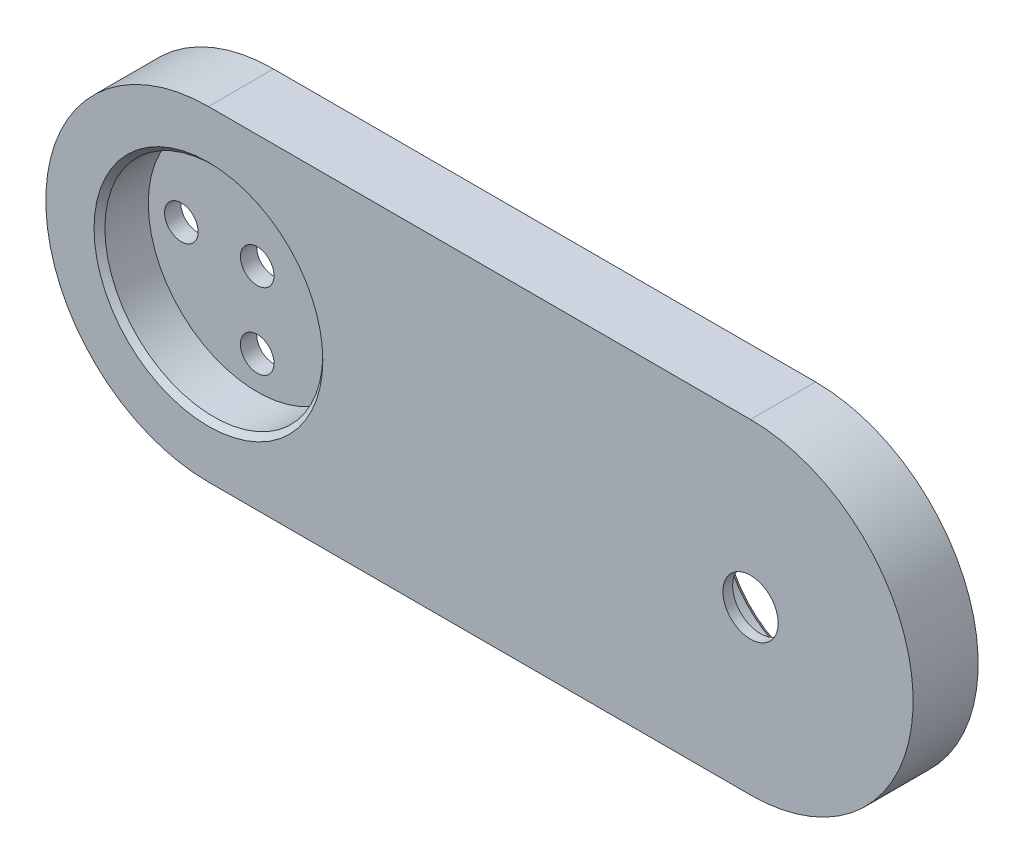
ISO-10303-21;
HEADER;
FILE_DESCRIPTION(('STEP AP214'),'2;1');
FILE_NAME('part.step','',(''),(''),'','','');
FILE_SCHEMA(('AUTOMOTIVE_DESIGN { 1 0 10303 214 1 1 1 1 }'));
ENDSEC;
DATA;
#1=APPLICATION_CONTEXT('core data for automotive mechanical design processes');
#2=APPLICATION_PROTOCOL_DEFINITION('international standard','automotive_design',2000,#1);
#3=PRODUCT_CONTEXT('',#1,'mechanical');
#4=PRODUCT('Part','Part','',(#3));
#5=PRODUCT_RELATED_PRODUCT_CATEGORY('part','',(#4));
#6=PRODUCT_DEFINITION_FORMATION('','',#4);
#7=PRODUCT_DEFINITION_CONTEXT('part definition',#1,'design');
#8=PRODUCT_DEFINITION('design','',#6,#7);
#9=PRODUCT_DEFINITION_SHAPE('','',#8);
#10=(LENGTH_UNIT() NAMED_UNIT(*) SI_UNIT(.MILLI.,.METRE.));
#11=(NAMED_UNIT(*) PLANE_ANGLE_UNIT() SI_UNIT($,.RADIAN.));
#12=(NAMED_UNIT(*) SI_UNIT($,.STERADIAN.) SOLID_ANGLE_UNIT());
#13=UNCERTAINTY_MEASURE_WITH_UNIT(LENGTH_MEASURE(1.E-05),#10,'distance_accuracy_value','');
#14=(GEOMETRIC_REPRESENTATION_CONTEXT(3) GLOBAL_UNCERTAINTY_ASSIGNED_CONTEXT((#13)) GLOBAL_UNIT_ASSIGNED_CONTEXT((#10,
#11,#12)) REPRESENTATION_CONTEXT('',''));
#15=CARTESIAN_POINT('',(0.,0.,0.));
#16=DIRECTION('',(0.,0.,1.));
#17=DIRECTION('',(1.,0.,0.));
#18=AXIS2_PLACEMENT_3D('',#15,#16,#17);
#19=CARTESIAN_POINT('',(-25.,0.,6.));
#20=DIRECTION('',(0.,0.,-1.));
#21=DIRECTION('',(-1.,0.,0.));
#22=AXIS2_PLACEMENT_3D('',#19,#20,#21);
#23=CYLINDRICAL_SURFACE('',#22,15.);
#24=CARTESIAN_POINT('',(-25.,0.,0.));
#25=DIRECTION('',(0.,0.,1.));
#26=DIRECTION('',(-1.,0.,0.));
#27=AXIS2_PLACEMENT_3D('',#24,#25,#26);
#28=CIRCLE('',#27,15.);
#29=CARTESIAN_POINT('',(-25.,15.,0.));
#30=VERTEX_POINT('',#29);
#31=CARTESIAN_POINT('',(-25.,-15.,0.));
#32=VERTEX_POINT('',#31);
#33=EDGE_CURVE('E120',#30,#32,#28,.T.);
#34=ORIENTED_EDGE('',*,*,#33,.T.);
#35=DIRECTION('',(0.,0.,-1.));
#36=VECTOR('',#35,1.);
#37=CARTESIAN_POINT('',(-25.,-15.,6.));
#38=LINE('',#37,#36);
#39=CARTESIAN_POINT('',(-25.,-15.,6.));
#40=VERTEX_POINT('',#39);
#41=EDGE_CURVE('E109',#40,#32,#38,.T.);
#42=ORIENTED_EDGE('',*,*,#41,.F.);
#43=CARTESIAN_POINT('',(-25.,0.,6.));
#44=DIRECTION('',(0.,0.,1.));
#45=DIRECTION('',(-1.,0.,0.));
#46=AXIS2_PLACEMENT_3D('',#43,#44,#45);
#47=CIRCLE('',#46,15.);
#48=CARTESIAN_POINT('',(-25.,15.,6.));
#49=VERTEX_POINT('',#48);
#50=EDGE_CURVE('E101',#49,#40,#47,.T.);
#51=ORIENTED_EDGE('',*,*,#50,.F.);
#52=DIRECTION('',(0.,0.,-1.));
#53=VECTOR('',#52,1.);
#54=CARTESIAN_POINT('',(-25.,15.,6.));
#55=LINE('',#54,#53);
#56=EDGE_CURVE('E116',#49,#30,#55,.T.);
#57=ORIENTED_EDGE('',*,*,#56,.T.);
#58=EDGE_LOOP('',(#34,#42,#51,#57));
#59=FACE_BOUND('',#58,.T.);
#60=ADVANCED_FACE('F46',(#59),#23,.T.);
#61=CARTESIAN_POINT('',(25.,-15.,6.));
#62=DIRECTION('',(0.,1.,0.));
#63=DIRECTION('',(0.,0.,1.));
#64=AXIS2_PLACEMENT_3D('',#61,#62,#63);
#65=PLANE('',#64);
#66=DIRECTION('',(1.,0.,0.));
#67=VECTOR('',#66,1.);
#68=CARTESIAN_POINT('',(25.,-15.,0.));
#69=LINE('',#68,#67);
#70=CARTESIAN_POINT('',(25.,-15.,0.));
#71=VERTEX_POINT('',#70);
#72=EDGE_CURVE('E107',#32,#71,#69,.T.);
#73=ORIENTED_EDGE('',*,*,#72,.T.);
#74=DIRECTION('',(0.,0.,-1.));
#75=VECTOR('',#74,1.);
#76=CARTESIAN_POINT('',(25.,-15.,6.));
#77=LINE('',#76,#75);
#78=CARTESIAN_POINT('',(25.,-15.,6.));
#79=VERTEX_POINT('',#78);
#80=EDGE_CURVE('E105',#79,#71,#77,.T.);
#81=ORIENTED_EDGE('',*,*,#80,.F.);
#82=DIRECTION('',(1.,0.,0.));
#83=VECTOR('',#82,1.);
#84=CARTESIAN_POINT('',(25.,-15.,6.));
#85=LINE('',#84,#83);
#86=EDGE_CURVE('E96',#40,#79,#85,.T.);
#87=ORIENTED_EDGE('',*,*,#86,.F.);
#88=ORIENTED_EDGE('',*,*,#41,.T.);
#89=EDGE_LOOP('',(#73,#81,#87,#88));
#90=FACE_BOUND('',#89,.T.);
#91=ADVANCED_FACE('F106',(#90),#65,.F.);
#92=CARTESIAN_POINT('',(25.,0.,6.));
#93=DIRECTION('',(0.,0.,-1.));
#94=DIRECTION('',(-1.,0.,0.));
#95=AXIS2_PLACEMENT_3D('',#92,#93,#94);
#96=CYLINDRICAL_SURFACE('',#95,15.);
#97=CARTESIAN_POINT('',(25.,0.,0.));
#98=DIRECTION('',(0.,0.,1.));
#99=DIRECTION('',(-1.,0.,0.));
#100=AXIS2_PLACEMENT_3D('',#97,#98,#99);
#101=CIRCLE('',#100,15.);
#102=CARTESIAN_POINT('',(25.,15.,0.));
#103=VERTEX_POINT('',#102);
#104=EDGE_CURVE('E82',#71,#103,#101,.T.);
#105=ORIENTED_EDGE('',*,*,#104,.T.);
#106=DIRECTION('',(0.,0.,-1.));
#107=VECTOR('',#106,1.);
#108=CARTESIAN_POINT('',(25.,15.,6.));
#109=LINE('',#108,#107);
#110=CARTESIAN_POINT('',(25.,15.,6.));
#111=VERTEX_POINT('',#110);
#112=EDGE_CURVE('E110',#111,#103,#109,.T.);
#113=ORIENTED_EDGE('',*,*,#112,.F.);
#114=CARTESIAN_POINT('',(25.,0.,6.));
#115=DIRECTION('',(0.,0.,1.));
#116=DIRECTION('',(-1.,0.,0.));
#117=AXIS2_PLACEMENT_3D('',#114,#115,#116);
#118=CIRCLE('',#117,15.);
#119=EDGE_CURVE('E99',#79,#111,#118,.T.);
#120=ORIENTED_EDGE('',*,*,#119,.F.);
#121=ORIENTED_EDGE('',*,*,#80,.T.);
#122=EDGE_LOOP('',(#105,#113,#120,#121));
#123=FACE_BOUND('',#122,.T.);
#124=ADVANCED_FACE('F112',(#123),#96,.T.);
#125=CARTESIAN_POINT('',(-25.,15.,6.));
#126=DIRECTION('',(0.,-1.,0.));
#127=DIRECTION('',(0.,0.,-1.));
#128=AXIS2_PLACEMENT_3D('',#125,#126,#127);
#129=PLANE('',#128);
#130=DIRECTION('',(-1.,0.,0.));
#131=VECTOR('',#130,1.);
#132=CARTESIAN_POINT('',(-25.,15.,0.));
#133=LINE('',#132,#131);
#134=EDGE_CURVE('E88',#103,#30,#133,.T.);
#135=ORIENTED_EDGE('',*,*,#134,.T.);
#136=ORIENTED_EDGE('',*,*,#56,.F.);
#137=DIRECTION('',(-1.,0.,0.));
#138=VECTOR('',#137,1.);
#139=CARTESIAN_POINT('',(-25.,15.,6.));
#140=LINE('',#139,#138);
#141=EDGE_CURVE('E65',#111,#49,#140,.T.);
#142=ORIENTED_EDGE('',*,*,#141,.F.);
#143=ORIENTED_EDGE('',*,*,#112,.T.);
#144=EDGE_LOOP('',(#135,#136,#142,#143));
#145=FACE_BOUND('',#144,.T.);
#146=ADVANCED_FACE('F175',(#145),#129,.F.);
#147=CARTESIAN_POINT('',(-25.,0.,6.));
#148=DIRECTION('',(0.,0.,-1.));
#149=DIRECTION('',(-1.,0.,0.));
#150=AXIS2_PLACEMENT_3D('',#147,#148,#149);
#151=PLANE('',#150);
#152=CARTESIAN_POINT('',(-25.,0.,6.));
#153=DIRECTION('',(0.,0.,-1.));
#154=DIRECTION('',(-1.,0.,0.));
#155=AXIS2_PLACEMENT_3D('',#152,#153,#154);
#156=CIRCLE('',#155,10.55);
#157=CARTESIAN_POINT('',(-35.55,0.,6.));
#158=VERTEX_POINT('',#157);
#159=EDGE_CURVE('E11',#158,#158,#156,.T.);
#160=ORIENTED_EDGE('',*,*,#159,.T.);
#161=EDGE_LOOP('',(#160));
#162=FACE_BOUND('',#161,.T.);
#163=CARTESIAN_POINT('',(25.,0.,6.));
#164=DIRECTION('',(0.,0.,-1.));
#165=DIRECTION('',(-1.,0.,0.));
#166=AXIS2_PLACEMENT_3D('',#163,#164,#165);
#167=CIRCLE('',#166,2.55);
#168=CARTESIAN_POINT('',(22.45,0.,6.));
#169=VERTEX_POINT('',#168);
#170=EDGE_CURVE('E269',#169,#169,#167,.T.);
#171=ORIENTED_EDGE('',*,*,#170,.T.);
#172=EDGE_LOOP('',(#171));
#173=FACE_BOUND('',#172,.T.);
#174=ORIENTED_EDGE('',*,*,#50,.T.);
#175=ORIENTED_EDGE('',*,*,#86,.T.);
#176=ORIENTED_EDGE('',*,*,#119,.T.);
#177=ORIENTED_EDGE('',*,*,#141,.T.);
#178=EDGE_LOOP('',(#174,#175,#176,#177));
#179=FACE_BOUND('',#178,.T.);
#180=ADVANCED_FACE('F97',(#162,#173,#179),#151,.F.);
#181=CARTESIAN_POINT('',(-25.,0.,0.));
#182=DIRECTION('',(0.,0.,-1.));
#183=DIRECTION('',(-1.,0.,0.));
#184=AXIS2_PLACEMENT_3D('',#181,#182,#183);
#185=PLANE('',#184);
#186=CARTESIAN_POINT('',(25.,0.,0.));
#187=DIRECTION('',(0.,0.,-1.));
#188=DIRECTION('',(-1.,0.,0.));
#189=AXIS2_PLACEMENT_3D('',#186,#187,#188);
#190=CIRCLE('',#189,8.47500000000002);
#191=CARTESIAN_POINT('',(16.525,0.,0.));
#192=VERTEX_POINT('',#191);
#193=EDGE_CURVE('E141',#192,#192,#190,.F.);
#194=ORIENTED_EDGE('',*,*,#193,.T.);
#195=EDGE_LOOP('',(#194));
#196=FACE_BOUND('',#195,.T.);
#197=CARTESIAN_POINT('',(-18.,0.,0.));
#198=DIRECTION('',(0.,0.,1.));
#199=DIRECTION('',(1.,0.,0.));
#200=AXIS2_PLACEMENT_3D('',#197,#198,#199);
#201=CIRCLE('',#200,1.55);
#202=CARTESIAN_POINT('',(-16.45,0.,0.));
#203=VERTEX_POINT('',#202);
#204=EDGE_CURVE('E254',#203,#203,#201,.T.);
#205=ORIENTED_EDGE('',*,*,#204,.T.);
#206=EDGE_LOOP('',(#205));
#207=FACE_BOUND('',#206,.T.);
#208=CARTESIAN_POINT('',(-32.,0.,0.));
#209=DIRECTION('',(0.,0.,1.));
#210=DIRECTION('',(1.,0.,0.));
#211=AXIS2_PLACEMENT_3D('',#208,#209,#210);
#212=CIRCLE('',#211,1.55);
#213=CARTESIAN_POINT('',(-30.45,0.,0.));
#214=VERTEX_POINT('',#213);
#215=EDGE_CURVE('E232',#214,#214,#212,.T.);
#216=ORIENTED_EDGE('',*,*,#215,.T.);
#217=EDGE_LOOP('',(#216));
#218=FACE_BOUND('',#217,.T.);
#219=CARTESIAN_POINT('',(-25.,7.,0.));
#220=DIRECTION('',(0.,0.,1.));
#221=DIRECTION('',(1.,0.,0.));
#222=AXIS2_PLACEMENT_3D('',#219,#220,#221);
#223=CIRCLE('',#222,1.55);
#224=CARTESIAN_POINT('',(-23.45,7.,0.));
#225=VERTEX_POINT('',#224);
#226=EDGE_CURVE('E226',#225,#225,#223,.T.);
#227=ORIENTED_EDGE('',*,*,#226,.T.);
#228=EDGE_LOOP('',(#227));
#229=FACE_BOUND('',#228,.T.);
#230=CARTESIAN_POINT('',(-25.,-7.,0.));
#231=DIRECTION('',(0.,0.,1.));
#232=DIRECTION('',(1.,0.,0.));
#233=AXIS2_PLACEMENT_3D('',#230,#231,#232);
#234=CIRCLE('',#233,1.55);
#235=CARTESIAN_POINT('',(-23.45,-7.,0.));
#236=VERTEX_POINT('',#235);
#237=EDGE_CURVE('E245',#236,#236,#234,.T.);
#238=ORIENTED_EDGE('',*,*,#237,.T.);
#239=EDGE_LOOP('',(#238));
#240=FACE_BOUND('',#239,.T.);
#241=CARTESIAN_POINT('',(-25.,0.,0.));
#242=DIRECTION('',(0.,0.,1.));
#243=DIRECTION('',(1.,0.,0.));
#244=AXIS2_PLACEMENT_3D('',#241,#242,#243);
#245=CIRCLE('',#244,1.55);
#246=CARTESIAN_POINT('',(-23.45,0.,0.));
#247=VERTEX_POINT('',#246);
#248=EDGE_CURVE('E261',#247,#247,#245,.T.);
#249=ORIENTED_EDGE('',*,*,#248,.T.);
#250=EDGE_LOOP('',(#249));
#251=FACE_BOUND('',#250,.T.);
#252=ORIENTED_EDGE('',*,*,#33,.F.);
#253=ORIENTED_EDGE('',*,*,#134,.F.);
#254=ORIENTED_EDGE('',*,*,#104,.F.);
#255=ORIENTED_EDGE('',*,*,#72,.F.);
#256=EDGE_LOOP('',(#252,#253,#254,#255));
#257=FACE_BOUND('',#256,.T.);
#258=ADVANCED_FACE('F178',(#196,#207,#218,#229,#240,#251,#257),#185,.T.);
#259=CARTESIAN_POINT('',(-25.,0.,1.5));
#260=DIRECTION('',(0.,0.,1.));
#261=DIRECTION('',(1.,0.,0.));
#262=AXIS2_PLACEMENT_3D('',#259,#260,#261);
#263=CYLINDRICAL_SURFACE('',#262,10.05);
#264=CARTESIAN_POINT('',(-25.,0.,5.49999999999999));
#265=DIRECTION('',(0.,0.,-1.));
#266=DIRECTION('',(-1.,0.,0.));
#267=AXIS2_PLACEMENT_3D('',#264,#265,#266);
#268=CIRCLE('',#267,10.05);
#269=CARTESIAN_POINT('',(-35.05,0.,5.49999999999999));
#270=VERTEX_POINT('',#269);
#271=EDGE_CURVE('E57',#270,#270,#268,.F.);
#272=ORIENTED_EDGE('',*,*,#271,.T.);
#273=EDGE_LOOP('',(#272));
#274=FACE_BOUND('',#273,.T.);
#275=CARTESIAN_POINT('',(-25.,0.,1.5));
#276=DIRECTION('',(0.,0.,1.));
#277=DIRECTION('',(1.,0.,0.));
#278=AXIS2_PLACEMENT_3D('',#275,#276,#277);
#279=CIRCLE('',#278,10.05);
#280=CARTESIAN_POINT('',(-14.95,0.,1.5));
#281=VERTEX_POINT('',#280);
#282=EDGE_CURVE('E124',#281,#281,#279,.T.);
#283=ORIENTED_EDGE('',*,*,#282,.F.);
#284=EDGE_LOOP('',(#283));
#285=FACE_BOUND('',#284,.T.);
#286=ADVANCED_FACE('F148',(#274,#285),#263,.F.);
#287=CARTESIAN_POINT('',(-25.,0.,1.5));
#288=DIRECTION('',(0.,0.,1.));
#289=DIRECTION('',(1.,0.,0.));
#290=AXIS2_PLACEMENT_3D('',#287,#288,#289);
#291=PLANE('',#290);
#292=CARTESIAN_POINT('',(-25.,0.,1.5));
#293=DIRECTION('',(0.,0.,1.));
#294=DIRECTION('',(1.,0.,0.));
#295=AXIS2_PLACEMENT_3D('',#292,#293,#294);
#296=CIRCLE('',#295,1.55);
#297=CARTESIAN_POINT('',(-23.45,0.,1.5));
#298=VERTEX_POINT('',#297);
#299=EDGE_CURVE('E253',#298,#298,#296,.T.);
#300=ORIENTED_EDGE('',*,*,#299,.F.);
#301=EDGE_LOOP('',(#300));
#302=FACE_BOUND('',#301,.T.);
#303=CARTESIAN_POINT('',(-18.,0.,1.5));
#304=DIRECTION('',(0.,0.,1.));
#305=DIRECTION('',(1.,0.,0.));
#306=AXIS2_PLACEMENT_3D('',#303,#304,#305);
#307=CIRCLE('',#306,1.55);
#308=CARTESIAN_POINT('',(-16.45,0.,1.5));
#309=VERTEX_POINT('',#308);
#310=EDGE_CURVE('E249',#309,#309,#307,.T.);
#311=ORIENTED_EDGE('',*,*,#310,.F.);
#312=EDGE_LOOP('',(#311));
#313=FACE_BOUND('',#312,.T.);
#314=CARTESIAN_POINT('',(-32.,0.,1.5));
#315=DIRECTION('',(0.,0.,1.));
#316=DIRECTION('',(1.,0.,0.));
#317=AXIS2_PLACEMENT_3D('',#314,#315,#316);
#318=CIRCLE('',#317,1.55);
#319=CARTESIAN_POINT('',(-30.45,0.,1.5));
#320=VERTEX_POINT('',#319);
#321=EDGE_CURVE('E237',#320,#320,#318,.T.);
#322=ORIENTED_EDGE('',*,*,#321,.F.);
#323=EDGE_LOOP('',(#322));
#324=FACE_BOUND('',#323,.T.);
#325=CARTESIAN_POINT('',(-25.,7.,1.5));
#326=DIRECTION('',(0.,0.,1.));
#327=DIRECTION('',(1.,0.,0.));
#328=AXIS2_PLACEMENT_3D('',#325,#326,#327);
#329=CIRCLE('',#328,1.55);
#330=CARTESIAN_POINT('',(-23.45,7.,1.5));
#331=VERTEX_POINT('',#330);
#332=EDGE_CURVE('E229',#331,#331,#329,.T.);
#333=ORIENTED_EDGE('',*,*,#332,.F.);
#334=EDGE_LOOP('',(#333));
#335=FACE_BOUND('',#334,.T.);
#336=CARTESIAN_POINT('',(-25.,-7.,1.5));
#337=DIRECTION('',(0.,0.,1.));
#338=DIRECTION('',(1.,0.,0.));
#339=AXIS2_PLACEMENT_3D('',#336,#337,#338);
#340=CIRCLE('',#339,1.55);
#341=CARTESIAN_POINT('',(-23.45,-7.,1.5));
#342=VERTEX_POINT('',#341);
#343=EDGE_CURVE('E239',#342,#342,#340,.T.);
#344=ORIENTED_EDGE('',*,*,#343,.F.);
#345=EDGE_LOOP('',(#344));
#346=FACE_BOUND('',#345,.T.);
#347=ORIENTED_EDGE('',*,*,#282,.T.);
#348=EDGE_LOOP('',(#347));
#349=FACE_BOUND('',#348,.T.);
#350=ADVANCED_FACE('F187',(#302,#313,#324,#335,#346,#349),#291,.T.);
#351=CARTESIAN_POINT('',(25.,0.,5.1));
#352=DIRECTION('',(0.,0.,-1.));
#353=DIRECTION('',(-1.,0.,0.));
#354=AXIS2_PLACEMENT_3D('',#351,#352,#353);
#355=CYLINDRICAL_SURFACE('',#354,7.975);
#356=CARTESIAN_POINT('',(25.,0.,0.500000000000011));
#357=DIRECTION('',(0.,0.,-1.));
#358=DIRECTION('',(-1.,0.,0.));
#359=AXIS2_PLACEMENT_3D('',#356,#357,#358);
#360=CIRCLE('',#359,7.975);
#361=CARTESIAN_POINT('',(17.025,0.,0.500000000000011));
#362=VERTEX_POINT('',#361);
#363=EDGE_CURVE('E137',#362,#362,#360,.T.);
#364=ORIENTED_EDGE('',*,*,#363,.T.);
#365=EDGE_LOOP('',(#364));
#366=FACE_BOUND('',#365,.T.);
#367=CARTESIAN_POINT('',(25.,0.,5.1));
#368=DIRECTION('',(0.,0.,-1.));
#369=DIRECTION('',(-1.,0.,0.));
#370=AXIS2_PLACEMENT_3D('',#367,#368,#369);
#371=CIRCLE('',#370,7.975);
#372=CARTESIAN_POINT('',(17.025,0.,5.1));
#373=VERTEX_POINT('',#372);
#374=EDGE_CURVE('E273',#373,#373,#371,.T.);
#375=ORIENTED_EDGE('',*,*,#374,.F.);
#376=EDGE_LOOP('',(#375));
#377=FACE_BOUND('',#376,.T.);
#378=ADVANCED_FACE('F190',(#366,#377),#355,.F.);
#379=CARTESIAN_POINT('',(25.,0.,5.1));
#380=DIRECTION('',(0.,0.,-1.));
#381=DIRECTION('',(-1.,0.,0.));
#382=AXIS2_PLACEMENT_3D('',#379,#380,#381);
#383=PLANE('',#382);
#384=CARTESIAN_POINT('',(25.,0.,5.1));
#385=DIRECTION('',(0.,0.,-1.));
#386=DIRECTION('',(-1.,0.,0.));
#387=AXIS2_PLACEMENT_3D('',#384,#385,#386);
#388=CIRCLE('',#387,2.55);
#389=CARTESIAN_POINT('',(22.45,0.,5.1));
#390=VERTEX_POINT('',#389);
#391=EDGE_CURVE('E265',#390,#390,#388,.T.);
#392=ORIENTED_EDGE('',*,*,#391,.F.);
#393=EDGE_LOOP('',(#392));
#394=FACE_BOUND('',#393,.T.);
#395=ORIENTED_EDGE('',*,*,#374,.T.);
#396=EDGE_LOOP('',(#395));
#397=FACE_BOUND('',#396,.T.);
#398=ADVANCED_FACE('F194',(#394,#397),#383,.T.);
#399=CARTESIAN_POINT('',(25.,0.,6.));
#400=DIRECTION('',(0.,0.,-1.));
#401=DIRECTION('',(-1.,0.,0.));
#402=AXIS2_PLACEMENT_3D('',#399,#400,#401);
#403=CYLINDRICAL_SURFACE('',#402,2.55);
#404=ORIENTED_EDGE('',*,*,#170,.F.);
#405=EDGE_LOOP('',(#404));
#406=FACE_BOUND('',#405,.T.);
#407=ORIENTED_EDGE('',*,*,#391,.T.);
#408=EDGE_LOOP('',(#407));
#409=FACE_BOUND('',#408,.T.);
#410=ADVANCED_FACE('F198',(#406,#409),#403,.F.);
#411=CARTESIAN_POINT('',(-25.,-7.,0.));
#412=DIRECTION('',(0.,0.,1.));
#413=DIRECTION('',(1.,0.,0.));
#414=AXIS2_PLACEMENT_3D('',#411,#412,#413);
#415=CYLINDRICAL_SURFACE('',#414,1.55);
#416=ORIENTED_EDGE('',*,*,#237,.F.);
#417=EDGE_LOOP('',(#416));
#418=FACE_BOUND('',#417,.T.);
#419=ORIENTED_EDGE('',*,*,#343,.T.);
#420=EDGE_LOOP('',(#419));
#421=FACE_BOUND('',#420,.T.);
#422=ADVANCED_FACE('F202',(#418,#421),#415,.F.);
#423=CARTESIAN_POINT('',(-25.,7.,0.));
#424=DIRECTION('',(0.,0.,1.));
#425=DIRECTION('',(1.,0.,0.));
#426=AXIS2_PLACEMENT_3D('',#423,#424,#425);
#427=CYLINDRICAL_SURFACE('',#426,1.55);
#428=ORIENTED_EDGE('',*,*,#226,.F.);
#429=EDGE_LOOP('',(#428));
#430=FACE_BOUND('',#429,.T.);
#431=ORIENTED_EDGE('',*,*,#332,.T.);
#432=EDGE_LOOP('',(#431));
#433=FACE_BOUND('',#432,.T.);
#434=ADVANCED_FACE('F211',(#430,#433),#427,.F.);
#435=CARTESIAN_POINT('',(-32.,0.,0.));
#436=DIRECTION('',(0.,0.,1.));
#437=DIRECTION('',(1.,0.,0.));
#438=AXIS2_PLACEMENT_3D('',#435,#436,#437);
#439=CYLINDRICAL_SURFACE('',#438,1.55);
#440=ORIENTED_EDGE('',*,*,#215,.F.);
#441=EDGE_LOOP('',(#440));
#442=FACE_BOUND('',#441,.T.);
#443=ORIENTED_EDGE('',*,*,#321,.T.);
#444=EDGE_LOOP('',(#443));
#445=FACE_BOUND('',#444,.T.);
#446=ADVANCED_FACE('F208',(#442,#445),#439,.F.);
#447=CARTESIAN_POINT('',(-18.,0.,0.));
#448=DIRECTION('',(0.,0.,1.));
#449=DIRECTION('',(1.,0.,0.));
#450=AXIS2_PLACEMENT_3D('',#447,#448,#449);
#451=CYLINDRICAL_SURFACE('',#450,1.55);
#452=ORIENTED_EDGE('',*,*,#204,.F.);
#453=EDGE_LOOP('',(#452));
#454=FACE_BOUND('',#453,.T.);
#455=ORIENTED_EDGE('',*,*,#310,.T.);
#456=EDGE_LOOP('',(#455));
#457=FACE_BOUND('',#456,.T.);
#458=ADVANCED_FACE('F206',(#454,#457),#451,.F.);
#459=CARTESIAN_POINT('',(-25.,0.,0.));
#460=DIRECTION('',(0.,0.,1.));
#461=DIRECTION('',(1.,0.,0.));
#462=AXIS2_PLACEMENT_3D('',#459,#460,#461);
#463=CYLINDRICAL_SURFACE('',#462,1.55);
#464=ORIENTED_EDGE('',*,*,#248,.F.);
#465=EDGE_LOOP('',(#464));
#466=FACE_BOUND('',#465,.T.);
#467=ORIENTED_EDGE('',*,*,#299,.T.);
#468=EDGE_LOOP('',(#467));
#469=FACE_BOUND('',#468,.T.);
#470=ADVANCED_FACE('F157',(#466,#469),#463,.F.);
#471=CARTESIAN_POINT('',(25.,0.,0.500000000000011));
#472=DIRECTION('',(0.,0.,-1.));
#473=DIRECTION('',(-1.,0.,0.));
#474=AXIS2_PLACEMENT_3D('',#471,#472,#473);
#475=CONICAL_SURFACE('',#474,7.975,0.785398163397455);
#476=ORIENTED_EDGE('',*,*,#193,.F.);
#477=EDGE_LOOP('',(#476));
#478=FACE_BOUND('',#477,.T.);
#479=ORIENTED_EDGE('',*,*,#363,.F.);
#480=EDGE_LOOP('',(#479));
#481=FACE_BOUND('',#480,.T.);
#482=ADVANCED_FACE('F152',(#478,#481),#475,.F.);
#483=CARTESIAN_POINT('',(-25.,0.,5.49999999999999));
#484=DIRECTION('',(0.,0.,1.));
#485=DIRECTION('',(1.,0.,0.));
#486=AXIS2_PLACEMENT_3D('',#483,#484,#485);
#487=CONICAL_SURFACE('',#486,10.05,0.785398163397441);
#488=ORIENTED_EDGE('',*,*,#159,.F.);
#489=EDGE_LOOP('',(#488));
#490=FACE_BOUND('',#489,.T.);
#491=ORIENTED_EDGE('',*,*,#271,.F.);
#492=EDGE_LOOP('',(#491));
#493=FACE_BOUND('',#492,.T.);
#494=ADVANCED_FACE('F49',(#490,#493),#487,.F.);
#495=CLOSED_SHELL('',(#60,#91,#124,#146,#180,#258,#286,#350,#378,#398,#410,#422,#434,#446,#458,
#470,#482,#494));
#496=MANIFOLD_SOLID_BREP('B2',#495);
#497=ADVANCED_BREP_SHAPE_REPRESENTATION('',(#18,#496),#14);
#498=SHAPE_DEFINITION_REPRESENTATION(#9,#497);
ENDSEC;
END-ISO-10303-21;
